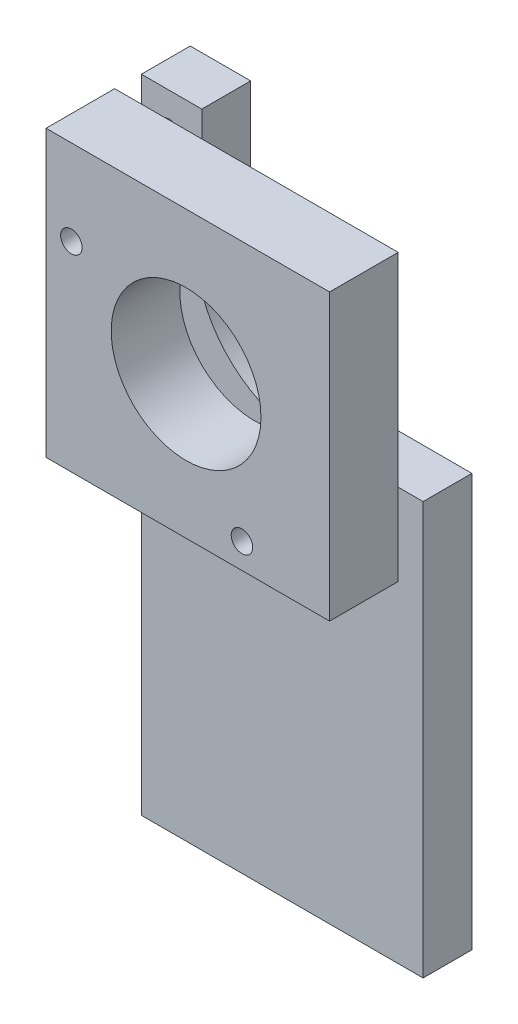
ISO-10303-21;
HEADER;
FILE_DESCRIPTION(('STEP AP214'),'2;1');
FILE_NAME('part.step','',(''),(''),'','','');
FILE_SCHEMA(('AUTOMOTIVE_DESIGN { 1 0 10303 214 1 1 1 1 }'));
ENDSEC;
DATA;
#1=APPLICATION_CONTEXT('core data for automotive mechanical design processes');
#2=APPLICATION_PROTOCOL_DEFINITION('international standard','automotive_design',2000,#1);
#3=PRODUCT_CONTEXT('',#1,'mechanical');
#4=PRODUCT('Part','Part','',(#3));
#5=PRODUCT_RELATED_PRODUCT_CATEGORY('part','',(#4));
#6=PRODUCT_DEFINITION_FORMATION('','',#4);
#7=PRODUCT_DEFINITION_CONTEXT('part definition',#1,'design');
#8=PRODUCT_DEFINITION('design','',#6,#7);
#9=PRODUCT_DEFINITION_SHAPE('','',#8);
#10=(LENGTH_UNIT() NAMED_UNIT(*) SI_UNIT(.MILLI.,.METRE.));
#11=(NAMED_UNIT(*) PLANE_ANGLE_UNIT() SI_UNIT($,.RADIAN.));
#12=(NAMED_UNIT(*) SI_UNIT($,.STERADIAN.) SOLID_ANGLE_UNIT());
#13=UNCERTAINTY_MEASURE_WITH_UNIT(LENGTH_MEASURE(1.E-05),#10,'distance_accuracy_value','');
#14=(GEOMETRIC_REPRESENTATION_CONTEXT(3) GLOBAL_UNCERTAINTY_ASSIGNED_CONTEXT((#13)) GLOBAL_UNIT_ASSIGNED_CONTEXT((#10,
#11,#12)) REPRESENTATION_CONTEXT('',''));
#15=CARTESIAN_POINT('',(0.,0.,0.));
#16=DIRECTION('',(0.,0.,1.));
#17=DIRECTION('',(1.,0.,0.));
#18=AXIS2_PLACEMENT_3D('',#15,#16,#17);
#19=CARTESIAN_POINT('',(0.,0.,7.95));
#20=DIRECTION('',(0.,0.,-1.));
#21=DIRECTION('',(-1.,0.,0.));
#22=AXIS2_PLACEMENT_3D('',#19,#20,#21);
#23=PLANE('',#22);
#24=DIRECTION('',(0.,-1.,0.));
#25=VECTOR('',#24,1.);
#26=CARTESIAN_POINT('',(0.,0.,7.95));
#27=LINE('',#26,#25);
#28=CARTESIAN_POINT('',(0.,33.04,7.95));
#29=VERTEX_POINT('',#28);
#30=CARTESIAN_POINT('',(0.,0.,7.95));
#31=VERTEX_POINT('',#30);
#32=EDGE_CURVE('E180',#29,#31,#27,.T.);
#33=ORIENTED_EDGE('',*,*,#32,.T.);
#34=DIRECTION('',(1.,0.,0.));
#35=VECTOR('',#34,1.);
#36=CARTESIAN_POINT('',(0.,0.,7.95));
#37=LINE('',#36,#35);
#38=CARTESIAN_POINT('',(32.86,0.,7.95));
#39=VERTEX_POINT('',#38);
#40=EDGE_CURVE('E80',#31,#39,#37,.T.);
#41=ORIENTED_EDGE('',*,*,#40,.T.);
#42=DIRECTION('',(0.,1.,0.));
#43=VECTOR('',#42,1.);
#44=CARTESIAN_POINT('',(32.86,0.,7.95));
#45=LINE('',#44,#43);
#46=CARTESIAN_POINT('',(32.86,33.04,7.95));
#47=VERTEX_POINT('',#46);
#48=EDGE_CURVE('E183',#39,#47,#45,.T.);
#49=ORIENTED_EDGE('',*,*,#48,.T.);
#50=DIRECTION('',(-1.,0.,0.));
#51=VECTOR('',#50,1.);
#52=CARTESIAN_POINT('',(0.,33.04,7.95));
#53=LINE('',#52,#51);
#54=EDGE_CURVE('E49',#47,#29,#53,.T.);
#55=ORIENTED_EDGE('',*,*,#54,.T.);
#56=EDGE_LOOP('',(#33,#41,#49,#55));
#57=FACE_BOUND('',#56,.T.);
#58=CARTESIAN_POINT('',(16.23,16.48,7.95));
#59=DIRECTION('',(0.,0.,1.));
#60=DIRECTION('',(1.,0.,0.));
#61=AXIS2_PLACEMENT_3D('',#58,#59,#60);
#62=CIRCLE('',#61,8.68);
#63=CARTESIAN_POINT('',(24.91,16.48,7.95));
#64=VERTEX_POINT('',#63);
#65=EDGE_CURVE('E174',#64,#64,#62,.T.);
#66=ORIENTED_EDGE('',*,*,#65,.F.);
#67=EDGE_LOOP('',(#66));
#68=FACE_BOUND('',#67,.T.);
#69=CARTESIAN_POINT('',(2.935,23.145,7.95));
#70=DIRECTION('',(0.,0.,1.));
#71=DIRECTION('',(1.,0.,0.));
#72=AXIS2_PLACEMENT_3D('',#69,#70,#71);
#73=CIRCLE('',#72,1.245);
#74=CARTESIAN_POINT('',(4.18,23.145,7.95));
#75=VERTEX_POINT('',#74);
#76=EDGE_CURVE('E168',#75,#75,#73,.T.);
#77=ORIENTED_EDGE('',*,*,#76,.F.);
#78=EDGE_LOOP('',(#77));
#79=FACE_BOUND('',#78,.T.);
#80=CARTESIAN_POINT('',(22.705,2.935,7.95));
#81=DIRECTION('',(0.,0.,1.));
#82=DIRECTION('',(1.,0.,0.));
#83=AXIS2_PLACEMENT_3D('',#80,#81,#82);
#84=CIRCLE('',#83,1.245);
#85=CARTESIAN_POINT('',(23.95,2.935,7.95));
#86=VERTEX_POINT('',#85);
#87=EDGE_CURVE('E162',#86,#86,#84,.T.);
#88=ORIENTED_EDGE('',*,*,#87,.F.);
#89=EDGE_LOOP('',(#88));
#90=FACE_BOUND('',#89,.T.);
#91=ADVANCED_FACE('F32',(#57,#68,#79,#90),#23,.F.);
#92=CARTESIAN_POINT('',(0.,0.,0.));
#93=DIRECTION('',(0.,0.,-1.));
#94=DIRECTION('',(-1.,0.,0.));
#95=AXIS2_PLACEMENT_3D('',#92,#93,#94);
#96=PLANE('',#95);
#97=CARTESIAN_POINT('',(3.30583870118861,28.8634109223374,0.));
#98=DIRECTION('',(0.,0.,-1.));
#99=DIRECTION('',(-1.,0.,0.));
#100=AXIS2_PLACEMENT_3D('',#97,#98,#99);
#101=CIRCLE('',#100,1.2717668887678);
#102=CARTESIAN_POINT('',(2.03407181242081,28.8634109223374,0.));
#103=VERTEX_POINT('',#102);
#104=EDGE_CURVE('E150',#103,#103,#101,.T.);
#105=ORIENTED_EDGE('',*,*,#104,.F.);
#106=EDGE_LOOP('',(#105));
#107=FACE_BOUND('',#106,.T.);
#108=CARTESIAN_POINT('',(2.935,23.145,0.));
#109=DIRECTION('',(0.,0.,1.));
#110=DIRECTION('',(1.,0.,0.));
#111=AXIS2_PLACEMENT_3D('',#108,#109,#110);
#112=CIRCLE('',#111,1.245);
#113=CARTESIAN_POINT('',(4.18,23.145,0.));
#114=VERTEX_POINT('',#113);
#115=EDGE_CURVE('E165',#114,#114,#112,.T.);
#116=ORIENTED_EDGE('',*,*,#115,.T.);
#117=EDGE_LOOP('',(#116));
#118=FACE_BOUND('',#117,.T.);
#119=DIRECTION('',(0.,-1.,0.));
#120=VECTOR('',#119,1.);
#121=CARTESIAN_POINT('',(0.,0.,0.));
#122=LINE('',#121,#120);
#123=CARTESIAN_POINT('',(0.,33.04,0.));
#124=VERTEX_POINT('',#123);
#125=CARTESIAN_POINT('',(0.,0.,0.));
#126=VERTEX_POINT('',#125);
#127=EDGE_CURVE('E177',#124,#126,#122,.T.);
#128=ORIENTED_EDGE('',*,*,#127,.F.);
#129=DIRECTION('',(-1.,0.,0.));
#130=VECTOR('',#129,1.);
#131=CARTESIAN_POINT('',(0.,33.04,0.));
#132=LINE('',#131,#130);
#133=CARTESIAN_POINT('',(32.86,33.04,0.));
#134=VERTEX_POINT('',#133);
#135=EDGE_CURVE('E73',#134,#124,#132,.T.);
#136=ORIENTED_EDGE('',*,*,#135,.F.);
#137=DIRECTION('',(0.,1.,0.));
#138=VECTOR('',#137,1.);
#139=CARTESIAN_POINT('',(32.86,0.,0.));
#140=LINE('',#139,#138);
#141=CARTESIAN_POINT('',(32.86,0.,0.));
#142=VERTEX_POINT('',#141);
#143=EDGE_CURVE('E67',#142,#134,#140,.T.);
#144=ORIENTED_EDGE('',*,*,#143,.F.);
#145=DIRECTION('',(1.,0.,0.));
#146=VECTOR('',#145,1.);
#147=CARTESIAN_POINT('',(0.,0.,0.));
#148=LINE('',#147,#146);
#149=EDGE_CURVE('E189',#126,#142,#148,.T.);
#150=ORIENTED_EDGE('',*,*,#149,.F.);
#151=EDGE_LOOP('',(#128,#136,#144,#150));
#152=FACE_BOUND('',#151,.T.);
#153=CARTESIAN_POINT('',(16.23,16.48,0.));
#154=DIRECTION('',(0.,0.,1.));
#155=DIRECTION('',(1.,0.,0.));
#156=AXIS2_PLACEMENT_3D('',#153,#154,#155);
#157=CIRCLE('',#156,8.68);
#158=CARTESIAN_POINT('',(24.91,16.48,0.));
#159=VERTEX_POINT('',#158);
#160=EDGE_CURVE('E171',#159,#159,#157,.T.);
#161=ORIENTED_EDGE('',*,*,#160,.T.);
#162=EDGE_LOOP('',(#161));
#163=FACE_BOUND('',#162,.T.);
#164=CARTESIAN_POINT('',(22.705,2.935,0.));
#165=DIRECTION('',(0.,0.,1.));
#166=DIRECTION('',(1.,0.,0.));
#167=AXIS2_PLACEMENT_3D('',#164,#165,#166);
#168=CIRCLE('',#167,1.245);
#169=CARTESIAN_POINT('',(23.95,2.935,0.));
#170=VERTEX_POINT('',#169);
#171=EDGE_CURVE('E160',#170,#170,#168,.T.);
#172=ORIENTED_EDGE('',*,*,#171,.T.);
#173=EDGE_LOOP('',(#172));
#174=FACE_BOUND('',#173,.T.);
#175=ADVANCED_FACE('F199',(#107,#118,#152,#163,#174),#96,.T.);
#176=CARTESIAN_POINT('',(0.,0.,7.95));
#177=DIRECTION('',(1.,0.,0.));
#178=DIRECTION('',(0.,1.,0.));
#179=AXIS2_PLACEMENT_3D('',#176,#177,#178);
#180=PLANE('',#179);
#181=ORIENTED_EDGE('',*,*,#127,.T.);
#182=DIRECTION('',(0.,0.,-1.));
#183=VECTOR('',#182,1.);
#184=CARTESIAN_POINT('',(0.,0.,7.95));
#185=LINE('',#184,#183);
#186=EDGE_CURVE('E11',#31,#126,#185,.T.);
#187=ORIENTED_EDGE('',*,*,#186,.F.);
#188=ORIENTED_EDGE('',*,*,#32,.F.);
#189=DIRECTION('',(0.,0.,-1.));
#190=VECTOR('',#189,1.);
#191=CARTESIAN_POINT('',(0.,33.04,7.95));
#192=LINE('',#191,#190);
#193=EDGE_CURVE('E186',#29,#124,#192,.T.);
#194=ORIENTED_EDGE('',*,*,#193,.T.);
#195=EDGE_LOOP('',(#181,#187,#188,#194));
#196=FACE_BOUND('',#195,.T.);
#197=ADVANCED_FACE('F34',(#196),#180,.F.);
#198=CARTESIAN_POINT('',(0.,0.,7.95));
#199=DIRECTION('',(0.,1.,0.));
#200=DIRECTION('',(0.,0.,1.));
#201=AXIS2_PLACEMENT_3D('',#198,#199,#200);
#202=PLANE('',#201);
#203=ORIENTED_EDGE('',*,*,#149,.T.);
#204=DIRECTION('',(0.,0.,-1.));
#205=VECTOR('',#204,1.);
#206=CARTESIAN_POINT('',(32.86,0.,7.95));
#207=LINE('',#206,#205);
#208=EDGE_CURVE('E41',#39,#142,#207,.T.);
#209=ORIENTED_EDGE('',*,*,#208,.F.);
#210=ORIENTED_EDGE('',*,*,#40,.F.);
#211=ORIENTED_EDGE('',*,*,#186,.T.);
#212=EDGE_LOOP('',(#203,#209,#210,#211));
#213=FACE_BOUND('',#212,.T.);
#214=ADVANCED_FACE('F215',(#213),#202,.F.);
#215=CARTESIAN_POINT('',(32.86,0.,7.95));
#216=DIRECTION('',(-1.,0.,0.));
#217=DIRECTION('',(0.,-1.,0.));
#218=AXIS2_PLACEMENT_3D('',#215,#216,#217);
#219=PLANE('',#218);
#220=ORIENTED_EDGE('',*,*,#143,.T.);
#221=DIRECTION('',(0.,0.,-1.));
#222=VECTOR('',#221,1.);
#223=CARTESIAN_POINT('',(32.86,33.04,7.95));
#224=LINE('',#223,#222);
#225=EDGE_CURVE('E194',#47,#134,#224,.T.);
#226=ORIENTED_EDGE('',*,*,#225,.F.);
#227=ORIENTED_EDGE('',*,*,#48,.F.);
#228=ORIENTED_EDGE('',*,*,#208,.T.);
#229=EDGE_LOOP('',(#220,#226,#227,#228));
#230=FACE_BOUND('',#229,.T.);
#231=ADVANCED_FACE('F196',(#230),#219,.F.);
#232=CARTESIAN_POINT('',(0.,33.04,7.95));
#233=DIRECTION('',(0.,-1.,0.));
#234=DIRECTION('',(0.,0.,-1.));
#235=AXIS2_PLACEMENT_3D('',#232,#233,#234);
#236=PLANE('',#235);
#237=ORIENTED_EDGE('',*,*,#135,.T.);
#238=ORIENTED_EDGE('',*,*,#193,.F.);
#239=ORIENTED_EDGE('',*,*,#54,.F.);
#240=ORIENTED_EDGE('',*,*,#225,.T.);
#241=EDGE_LOOP('',(#237,#238,#239,#240));
#242=FACE_BOUND('',#241,.T.);
#243=ADVANCED_FACE('F204',(#242),#236,.F.);
#244=CARTESIAN_POINT('',(16.23,16.48,7.95));
#245=DIRECTION('',(0.,0.,-1.));
#246=DIRECTION('',(-1.,0.,0.));
#247=AXIS2_PLACEMENT_3D('',#244,#245,#246);
#248=CYLINDRICAL_SURFACE('',#247,8.68);
#249=ORIENTED_EDGE('',*,*,#65,.T.);
#250=EDGE_LOOP('',(#249));
#251=FACE_BOUND('',#250,.T.);
#252=ORIENTED_EDGE('',*,*,#160,.F.);
#253=EDGE_LOOP('',(#252));
#254=FACE_BOUND('',#253,.T.);
#255=ADVANCED_FACE('F206',(#251,#254),#248,.F.);
#256=CARTESIAN_POINT('',(2.935,23.145,7.95));
#257=DIRECTION('',(0.,0.,-1.));
#258=DIRECTION('',(-1.,0.,0.));
#259=AXIS2_PLACEMENT_3D('',#256,#257,#258);
#260=CYLINDRICAL_SURFACE('',#259,1.245);
#261=ORIENTED_EDGE('',*,*,#76,.T.);
#262=EDGE_LOOP('',(#261));
#263=FACE_BOUND('',#262,.T.);
#264=ORIENTED_EDGE('',*,*,#115,.F.);
#265=EDGE_LOOP('',(#264));
#266=FACE_BOUND('',#265,.T.);
#267=ADVANCED_FACE('F212',(#263,#266),#260,.F.);
#268=CARTESIAN_POINT('',(22.705,2.935,7.95));
#269=DIRECTION('',(0.,0.,-1.));
#270=DIRECTION('',(-1.,0.,0.));
#271=AXIS2_PLACEMENT_3D('',#268,#269,#270);
#272=CYLINDRICAL_SURFACE('',#271,1.245);
#273=ORIENTED_EDGE('',*,*,#87,.T.);
#274=EDGE_LOOP('',(#273));
#275=FACE_BOUND('',#274,.T.);
#276=ORIENTED_EDGE('',*,*,#171,.F.);
#277=EDGE_LOOP('',(#276));
#278=FACE_BOUND('',#277,.T.);
#279=ADVANCED_FACE('F228',(#275,#278),#272,.F.);
#280=CARTESIAN_POINT('',(3.30583870118861,28.8634109223374,-3.));
#281=DIRECTION('',(0.,0.,1.));
#282=DIRECTION('',(1.,0.,0.));
#283=AXIS2_PLACEMENT_3D('',#280,#281,#282);
#284=CYLINDRICAL_SURFACE('',#283,1.2717668887678);
#285=CARTESIAN_POINT('',(3.30583870118861,28.8634109223374,-3.));
#286=DIRECTION('',(0.,0.,-1.));
#287=DIRECTION('',(-1.,0.,0.));
#288=AXIS2_PLACEMENT_3D('',#285,#286,#287);
#289=CIRCLE('',#288,1.2717668887678);
#290=CARTESIAN_POINT('',(2.03407181242081,28.8634109223374,-3.));
#291=VERTEX_POINT('',#290);
#292=EDGE_CURVE('E153',#291,#291,#289,.T.);
#293=ORIENTED_EDGE('',*,*,#292,.F.);
#294=EDGE_LOOP('',(#293));
#295=FACE_BOUND('',#294,.T.);
#296=ORIENTED_EDGE('',*,*,#104,.T.);
#297=EDGE_LOOP('',(#296));
#298=FACE_BOUND('',#297,.T.);
#299=ADVANCED_FACE('F232',(#295,#298),#284,.T.);
#300=CARTESIAN_POINT('',(0.0999999999999846,33.04,-8.66));
#301=DIRECTION('',(1.,0.,0.));
#302=DIRECTION('',(0.,1.,0.));
#303=AXIS2_PLACEMENT_3D('',#300,#301,#302);
#304=PLANE('',#303);
#305=DIRECTION('',(0.,1.,0.));
#306=VECTOR('',#305,1.);
#307=CARTESIAN_POINT('',(0.0999999999999846,33.04,-3.));
#308=LINE('',#307,#306);
#309=CARTESIAN_POINT('',(0.0999999999999754,-41.35,-3.));
#310=VERTEX_POINT('',#309);
#311=CARTESIAN_POINT('',(0.0999999999999846,33.04,-3.));
#312=VERTEX_POINT('',#311);
#313=EDGE_CURVE('E149',#310,#312,#308,.T.);
#314=ORIENTED_EDGE('',*,*,#313,.T.);
#315=DIRECTION('',(0.,0.,1.));
#316=VECTOR('',#315,1.);
#317=CARTESIAN_POINT('',(0.0999999999999846,33.04,-8.66));
#318=LINE('',#317,#316);
#319=CARTESIAN_POINT('',(0.0999999999999846,33.04,-8.66));
#320=VERTEX_POINT('',#319);
#321=EDGE_CURVE('E129',#320,#312,#318,.T.);
#322=ORIENTED_EDGE('',*,*,#321,.F.);
#323=DIRECTION('',(0.,1.,0.));
#324=VECTOR('',#323,1.);
#325=CARTESIAN_POINT('',(0.0999999999999846,33.04,-8.66));
#326=LINE('',#325,#324);
#327=CARTESIAN_POINT('',(0.0999999999999754,-41.35,-8.66));
#328=VERTEX_POINT('',#327);
#329=EDGE_CURVE('E136',#328,#320,#326,.T.);
#330=ORIENTED_EDGE('',*,*,#329,.F.);
#331=DIRECTION('',(0.,0.,1.));
#332=VECTOR('',#331,1.);
#333=CARTESIAN_POINT('',(0.0999999999999754,-41.35,-8.66));
#334=LINE('',#333,#332);
#335=EDGE_CURVE('E398',#328,#310,#334,.T.);
#336=ORIENTED_EDGE('',*,*,#335,.T.);
#337=EDGE_LOOP('',(#314,#322,#330,#336));
#338=FACE_BOUND('',#337,.T.);
#339=ADVANCED_FACE('F147',(#338),#304,.F.);
#340=CARTESIAN_POINT('',(0.0999999999999846,33.04,-8.66));
#341=DIRECTION('',(0.,-1.,0.));
#342=DIRECTION('',(0.,0.,-1.));
#343=AXIS2_PLACEMENT_3D('',#340,#341,#342);
#344=PLANE('',#343);
#345=DIRECTION('',(1.,0.,0.));
#346=VECTOR('',#345,1.);
#347=CARTESIAN_POINT('',(0.0999999999999846,33.04,-3.));
#348=LINE('',#347,#346);
#349=CARTESIAN_POINT('',(7.09999999999999,33.04,-3.));
#350=VERTEX_POINT('',#349);
#351=EDGE_CURVE('E383',#312,#350,#348,.T.);
#352=ORIENTED_EDGE('',*,*,#351,.T.);
#353=DIRECTION('',(0.,0.,1.));
#354=VECTOR('',#353,1.);
#355=CARTESIAN_POINT('',(7.09999999999999,33.04,-8.66));
#356=LINE('',#355,#354);
#357=CARTESIAN_POINT('',(7.09999999999999,33.04,-8.66));
#358=VERTEX_POINT('',#357);
#359=EDGE_CURVE('E132',#358,#350,#356,.T.);
#360=ORIENTED_EDGE('',*,*,#359,.F.);
#361=DIRECTION('',(1.,0.,0.));
#362=VECTOR('',#361,1.);
#363=CARTESIAN_POINT('',(0.0999999999999846,33.04,-8.66));
#364=LINE('',#363,#362);
#365=EDGE_CURVE('E125',#320,#358,#364,.T.);
#366=ORIENTED_EDGE('',*,*,#365,.F.);
#367=ORIENTED_EDGE('',*,*,#321,.T.);
#368=EDGE_LOOP('',(#352,#360,#366,#367));
#369=FACE_BOUND('',#368,.T.);
#370=ADVANCED_FACE('F127',(#369),#344,.F.);
#371=CARTESIAN_POINT('',(7.09999999999999,33.04,-8.66));
#372=DIRECTION('',(-1.,0.,0.));
#373=DIRECTION('',(0.,-1.,0.));
#374=AXIS2_PLACEMENT_3D('',#371,#372,#373);
#375=PLANE('',#374);
#376=DIRECTION('',(0.,-1.,0.));
#377=VECTOR('',#376,1.);
#378=CARTESIAN_POINT('',(7.09999999999999,33.04,-3.));
#379=LINE('',#378,#377);
#380=CARTESIAN_POINT('',(7.09999999999999,23.04,-3.));
#381=VERTEX_POINT('',#380);
#382=EDGE_CURVE('E385',#350,#381,#379,.T.);
#383=ORIENTED_EDGE('',*,*,#382,.T.);
#384=DIRECTION('',(0.,0.,1.));
#385=VECTOR('',#384,1.);
#386=CARTESIAN_POINT('',(7.09999999999999,23.04,-8.66));
#387=LINE('',#386,#385);
#388=CARTESIAN_POINT('',(7.09999999999999,23.04,-8.66));
#389=VERTEX_POINT('',#388);
#390=EDGE_CURVE('E155',#389,#381,#387,.T.);
#391=ORIENTED_EDGE('',*,*,#390,.F.);
#392=DIRECTION('',(0.,-1.,0.));
#393=VECTOR('',#392,1.);
#394=CARTESIAN_POINT('',(7.09999999999999,33.04,-8.66));
#395=LINE('',#394,#393);
#396=EDGE_CURVE('E135',#358,#389,#395,.T.);
#397=ORIENTED_EDGE('',*,*,#396,.F.);
#398=ORIENTED_EDGE('',*,*,#359,.T.);
#399=EDGE_LOOP('',(#383,#391,#397,#398));
#400=FACE_BOUND('',#399,.T.);
#401=ADVANCED_FACE('F241',(#400),#375,.F.);
#402=CARTESIAN_POINT('',(19.4963801114967,18.8460367445034,-8.66));
#403=DIRECTION('',(0.,0.,1.));
#404=DIRECTION('',(1.,0.,0.));
#405=AXIS2_PLACEMENT_3D('',#402,#403,#404);
#406=CYLINDRICAL_SURFACE('',#405,13.0866178845861);
#407=CARTESIAN_POINT('',(19.4963801114967,18.8460367445034,-3.));
#408=DIRECTION('',(0.,0.,1.));
#409=DIRECTION('',(-1.,0.,0.));
#410=AXIS2_PLACEMENT_3D('',#407,#408,#409);
#411=CIRCLE('',#410,13.0866178845861);
#412=CARTESIAN_POINT('',(23.75,6.46999999999999,-3.));
#413=VERTEX_POINT('',#412);
#414=EDGE_CURVE('E391',#381,#413,#411,.T.);
#415=ORIENTED_EDGE('',*,*,#414,.T.);
#416=DIRECTION('',(0.,0.,1.));
#417=VECTOR('',#416,1.);
#418=CARTESIAN_POINT('',(23.75,6.46999999999999,-8.66));
#419=LINE('',#418,#417);
#420=CARTESIAN_POINT('',(23.75,6.46999999999999,-8.66));
#421=VERTEX_POINT('',#420);
#422=EDGE_CURVE('E406',#421,#413,#419,.T.);
#423=ORIENTED_EDGE('',*,*,#422,.F.);
#424=CARTESIAN_POINT('',(19.4963801114967,18.8460367445034,-8.66));
#425=DIRECTION('',(0.,0.,1.));
#426=DIRECTION('',(-1.,0.,0.));
#427=AXIS2_PLACEMENT_3D('',#424,#425,#426);
#428=CIRCLE('',#427,13.0866178845861);
#429=EDGE_CURVE('E413',#389,#421,#428,.T.);
#430=ORIENTED_EDGE('',*,*,#429,.F.);
#431=ORIENTED_EDGE('',*,*,#390,.T.);
#432=EDGE_LOOP('',(#415,#423,#430,#431));
#433=FACE_BOUND('',#432,.T.);
#434=ADVANCED_FACE('F244',(#433),#406,.F.);
#435=CARTESIAN_POINT('',(32.75,6.47,-8.66));
#436=DIRECTION('',(0.,-1.,0.));
#437=DIRECTION('',(0.,0.,-1.));
#438=AXIS2_PLACEMENT_3D('',#435,#436,#437);
#439=PLANE('',#438);
#440=DIRECTION('',(1.,0.,0.));
#441=VECTOR('',#440,1.);
#442=CARTESIAN_POINT('',(32.75,6.47,-3.));
#443=LINE('',#442,#441);
#444=CARTESIAN_POINT('',(32.75,6.47,-3.));
#445=VERTEX_POINT('',#444);
#446=EDGE_CURVE('E393',#413,#445,#443,.T.);
#447=ORIENTED_EDGE('',*,*,#446,.T.);
#448=DIRECTION('',(0.,0.,1.));
#449=VECTOR('',#448,1.);
#450=CARTESIAN_POINT('',(32.75,6.47,-8.66));
#451=LINE('',#450,#449);
#452=CARTESIAN_POINT('',(32.75,6.47,-8.66));
#453=VERTEX_POINT('',#452);
#454=EDGE_CURVE('E403',#453,#445,#451,.T.);
#455=ORIENTED_EDGE('',*,*,#454,.F.);
#456=DIRECTION('',(1.,0.,0.));
#457=VECTOR('',#456,1.);
#458=CARTESIAN_POINT('',(32.75,6.47,-8.66));
#459=LINE('',#458,#457);
#460=EDGE_CURVE('E420',#421,#453,#459,.T.);
#461=ORIENTED_EDGE('',*,*,#460,.F.);
#462=ORIENTED_EDGE('',*,*,#422,.T.);
#463=EDGE_LOOP('',(#447,#455,#461,#462));
#464=FACE_BOUND('',#463,.T.);
#465=ADVANCED_FACE('F248',(#464),#439,.F.);
#466=CARTESIAN_POINT('',(32.75,6.47,-8.66));
#467=DIRECTION('',(-1.,0.,0.));
#468=DIRECTION('',(0.,-1.,0.));
#469=AXIS2_PLACEMENT_3D('',#466,#467,#468);
#470=PLANE('',#469);
#471=DIRECTION('',(0.,-1.,0.));
#472=VECTOR('',#471,1.);
#473=CARTESIAN_POINT('',(32.75,6.47,-3.));
#474=LINE('',#473,#472);
#475=CARTESIAN_POINT('',(32.75,-41.35,-3.));
#476=VERTEX_POINT('',#475);
#477=EDGE_CURVE('E395',#445,#476,#474,.T.);
#478=ORIENTED_EDGE('',*,*,#477,.T.);
#479=DIRECTION('',(0.,0.,1.));
#480=VECTOR('',#479,1.);
#481=CARTESIAN_POINT('',(32.75,-41.35,-8.66));
#482=LINE('',#481,#480);
#483=CARTESIAN_POINT('',(32.75,-41.35,-8.66));
#484=VERTEX_POINT('',#483);
#485=EDGE_CURVE('E400',#484,#476,#482,.T.);
#486=ORIENTED_EDGE('',*,*,#485,.F.);
#487=DIRECTION('',(0.,-1.,0.));
#488=VECTOR('',#487,1.);
#489=CARTESIAN_POINT('',(32.75,6.47,-8.66));
#490=LINE('',#489,#488);
#491=EDGE_CURVE('E419',#453,#484,#490,.T.);
#492=ORIENTED_EDGE('',*,*,#491,.F.);
#493=ORIENTED_EDGE('',*,*,#454,.T.);
#494=EDGE_LOOP('',(#478,#486,#492,#493));
#495=FACE_BOUND('',#494,.T.);
#496=ADVANCED_FACE('F252',(#495),#470,.F.);
#497=CARTESIAN_POINT('',(0.0999999999999754,-41.35,-8.66));
#498=DIRECTION('',(0.,1.,0.));
#499=DIRECTION('',(0.,0.,1.));
#500=AXIS2_PLACEMENT_3D('',#497,#498,#499);
#501=PLANE('',#500);
#502=DIRECTION('',(-1.,0.,0.));
#503=VECTOR('',#502,1.);
#504=CARTESIAN_POINT('',(0.0999999999999754,-41.35,-3.));
#505=LINE('',#504,#503);
#506=EDGE_CURVE('E145',#476,#310,#505,.T.);
#507=ORIENTED_EDGE('',*,*,#506,.T.);
#508=ORIENTED_EDGE('',*,*,#335,.F.);
#509=DIRECTION('',(-1.,0.,0.));
#510=VECTOR('',#509,1.);
#511=CARTESIAN_POINT('',(0.0999999999999754,-41.35,-8.66));
#512=LINE('',#511,#510);
#513=EDGE_CURVE('E141',#484,#328,#512,.T.);
#514=ORIENTED_EDGE('',*,*,#513,.F.);
#515=ORIENTED_EDGE('',*,*,#485,.T.);
#516=EDGE_LOOP('',(#507,#508,#514,#515));
#517=FACE_BOUND('',#516,.T.);
#518=ADVANCED_FACE('F256',(#517),#501,.F.);
#519=CARTESIAN_POINT('',(19.4963801114967,18.8460367445034,-8.66));
#520=DIRECTION('',(0.,0.,-1.));
#521=DIRECTION('',(-1.,0.,0.));
#522=AXIS2_PLACEMENT_3D('',#519,#520,#521);
#523=PLANE('',#522);
#524=ORIENTED_EDGE('',*,*,#329,.T.);
#525=ORIENTED_EDGE('',*,*,#365,.T.);
#526=ORIENTED_EDGE('',*,*,#396,.T.);
#527=ORIENTED_EDGE('',*,*,#429,.T.);
#528=ORIENTED_EDGE('',*,*,#460,.T.);
#529=ORIENTED_EDGE('',*,*,#491,.T.);
#530=ORIENTED_EDGE('',*,*,#513,.T.);
#531=EDGE_LOOP('',(#524,#525,#526,#527,#528,#529,#530));
#532=FACE_BOUND('',#531,.T.);
#533=ADVANCED_FACE('F139',(#532),#523,.T.);
#534=CARTESIAN_POINT('',(19.4963801114967,18.8460367445034,-3.));
#535=DIRECTION('',(0.,0.,-1.));
#536=DIRECTION('',(-1.,0.,0.));
#537=AXIS2_PLACEMENT_3D('',#534,#535,#536);
#538=PLANE('',#537);
#539=ORIENTED_EDGE('',*,*,#292,.T.);
#540=EDGE_LOOP('',(#539));
#541=FACE_BOUND('',#540,.T.);
#542=ORIENTED_EDGE('',*,*,#313,.F.);
#543=ORIENTED_EDGE('',*,*,#506,.F.);
#544=ORIENTED_EDGE('',*,*,#477,.F.);
#545=ORIENTED_EDGE('',*,*,#446,.F.);
#546=ORIENTED_EDGE('',*,*,#414,.F.);
#547=ORIENTED_EDGE('',*,*,#382,.F.);
#548=ORIENTED_EDGE('',*,*,#351,.F.);
#549=EDGE_LOOP('',(#542,#543,#544,#545,#546,#547,#548));
#550=FACE_BOUND('',#549,.T.);
#551=ADVANCED_FACE('F261',(#541,#550),#538,.F.);
#552=CLOSED_SHELL('',(#91,#175,#197,#214,#231,#243,#255,#267,#279,#299,#339,#370,#401,#434,#465,
#496,#518,#533,#551));
#553=MANIFOLD_SOLID_BREP('B2',#552);
#554=ADVANCED_BREP_SHAPE_REPRESENTATION('',(#18,#553),#14);
#555=SHAPE_DEFINITION_REPRESENTATION(#9,#554);
ENDSEC;
END-ISO-10303-21;
